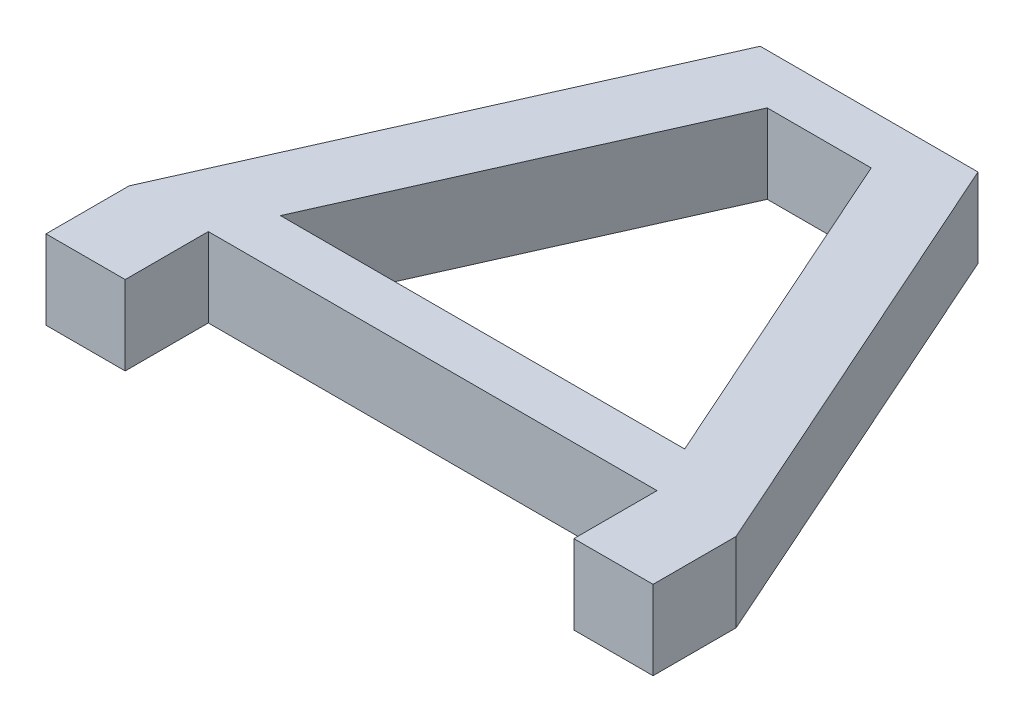
ISO-10303-21;
HEADER;
FILE_DESCRIPTION(('STEP AP214'),'2;1');
FILE_NAME('part.step','',(''),(''),'','','');
FILE_SCHEMA(('AUTOMOTIVE_DESIGN { 1 0 10303 214 1 1 1 1 }'));
ENDSEC;
DATA;
#1=APPLICATION_CONTEXT('core data for automotive mechanical design processes');
#2=APPLICATION_PROTOCOL_DEFINITION('international standard','automotive_design',2000,#1);
#3=PRODUCT_CONTEXT('',#1,'mechanical');
#4=PRODUCT('Part','Part','',(#3));
#5=PRODUCT_RELATED_PRODUCT_CATEGORY('part','',(#4));
#6=PRODUCT_DEFINITION_FORMATION('','',#4);
#7=PRODUCT_DEFINITION_CONTEXT('part definition',#1,'design');
#8=PRODUCT_DEFINITION('design','',#6,#7);
#9=PRODUCT_DEFINITION_SHAPE('','',#8);
#10=(LENGTH_UNIT() NAMED_UNIT(*) SI_UNIT(.MILLI.,.METRE.));
#11=(NAMED_UNIT(*) PLANE_ANGLE_UNIT() SI_UNIT($,.RADIAN.));
#12=(NAMED_UNIT(*) SI_UNIT($,.STERADIAN.) SOLID_ANGLE_UNIT());
#13=UNCERTAINTY_MEASURE_WITH_UNIT(LENGTH_MEASURE(1.E-05),#10,'distance_accuracy_value','');
#14=(GEOMETRIC_REPRESENTATION_CONTEXT(3) GLOBAL_UNCERTAINTY_ASSIGNED_CONTEXT((#13)) GLOBAL_UNIT_ASSIGNED_CONTEXT((#10,
#11,#12)) REPRESENTATION_CONTEXT('',''));
#15=CARTESIAN_POINT('',(0.,0.,0.));
#16=DIRECTION('',(0.,0.,1.));
#17=DIRECTION('',(1.,0.,0.));
#18=AXIS2_PLACEMENT_3D('',#15,#16,#17);
#19=CARTESIAN_POINT('',(0.,19.05,0.));
#20=DIRECTION('',(0.,-1.,0.));
#21=DIRECTION('',(0.,0.,-1.));
#22=AXIS2_PLACEMENT_3D('',#19,#20,#21);
#23=PLANE('',#22);
#24=DIRECTION('',(0.,0.,-1.));
#25=VECTOR('',#24,1.);
#26=CARTESIAN_POINT('',(73.025,19.05,10.));
#27=LINE('',#26,#25);
#28=CARTESIAN_POINT('',(73.025,19.05,10.));
#29=VERTEX_POINT('',#28);
#30=CARTESIAN_POINT('',(73.025,19.05,-10.));
#31=VERTEX_POINT('',#30);
#32=EDGE_CURVE('E172',#29,#31,#27,.T.);
#33=ORIENTED_EDGE('',*,*,#32,.T.);
#34=DIRECTION('',(-0.407299877583496,0.,-0.913294481380715));
#35=VECTOR('',#34,1.);
#36=CARTESIAN_POINT('',(73.025,19.05,-10.));
#37=LINE('',#36,#35);
#38=CARTESIAN_POINT('',(26.1983870967742,19.05,-115.));
#39=VERTEX_POINT('',#38);
#40=EDGE_CURVE('E175',#31,#39,#37,.T.);
#41=ORIENTED_EDGE('',*,*,#40,.T.);
#42=DIRECTION('',(-1.,0.,0.));
#43=VECTOR('',#42,1.);
#44=CARTESIAN_POINT('',(-26.1983870967742,19.05,-115.));
#45=LINE('',#44,#43);
#46=CARTESIAN_POINT('',(-26.1983870967742,19.05,-115.));
#47=VERTEX_POINT('',#46);
#48=EDGE_CURVE('E178',#39,#47,#45,.T.);
#49=ORIENTED_EDGE('',*,*,#48,.T.);
#50=DIRECTION('',(-0.407299877583496,0.,0.913294481380715));
#51=VECTOR('',#50,1.);
#52=CARTESIAN_POINT('',(-73.025,19.05,-10.));
#53=LINE('',#52,#51);
#54=CARTESIAN_POINT('',(-73.025,19.05,-10.));
#55=VERTEX_POINT('',#54);
#56=EDGE_CURVE('E180',#47,#55,#53,.T.);
#57=ORIENTED_EDGE('',*,*,#56,.T.);
#58=DIRECTION('',(0.,0.,1.));
#59=VECTOR('',#58,1.);
#60=CARTESIAN_POINT('',(-73.025,19.05,10.));
#61=LINE('',#60,#59);
#62=CARTESIAN_POINT('',(-73.025,19.05,10.));
#63=VERTEX_POINT('',#62);
#64=EDGE_CURVE('E182',#55,#63,#61,.T.);
#65=ORIENTED_EDGE('',*,*,#64,.T.);
#66=DIRECTION('',(1.,0.,0.));
#67=VECTOR('',#66,1.);
#68=CARTESIAN_POINT('',(-73.025,19.05,10.));
#69=LINE('',#68,#67);
#70=CARTESIAN_POINT('',(-53.975,19.05,10.));
#71=VERTEX_POINT('',#70);
#72=EDGE_CURVE('E184',#63,#71,#69,.T.);
#73=ORIENTED_EDGE('',*,*,#72,.T.);
#74=DIRECTION('',(0.,0.,-1.));
#75=VECTOR('',#74,1.);
#76=CARTESIAN_POINT('',(-53.975,19.05,-10.));
#77=LINE('',#76,#75);
#78=CARTESIAN_POINT('',(-53.975,19.05,-10.));
#79=VERTEX_POINT('',#78);
#80=EDGE_CURVE('E186',#71,#79,#77,.T.);
#81=ORIENTED_EDGE('',*,*,#80,.T.);
#82=DIRECTION('',(1.,0.,0.));
#83=VECTOR('',#82,1.);
#84=CARTESIAN_POINT('',(-53.975,19.05,-10.));
#85=LINE('',#84,#83);
#86=CARTESIAN_POINT('',(53.975,19.05,-10.));
#87=VERTEX_POINT('',#86);
#88=EDGE_CURVE('E188',#79,#87,#85,.T.);
#89=ORIENTED_EDGE('',*,*,#88,.T.);
#90=DIRECTION('',(0.,0.,1.));
#91=VECTOR('',#90,1.);
#92=CARTESIAN_POINT('',(53.975,19.05,-10.));
#93=LINE('',#92,#91);
#94=CARTESIAN_POINT('',(53.975,19.05,10.));
#95=VERTEX_POINT('',#94);
#96=EDGE_CURVE('E190',#87,#95,#93,.T.);
#97=ORIENTED_EDGE('',*,*,#96,.T.);
#98=DIRECTION('',(1.,0.,0.));
#99=VECTOR('',#98,1.);
#100=CARTESIAN_POINT('',(73.025,19.05,10.));
#101=LINE('',#100,#99);
#102=EDGE_CURVE('E192',#95,#29,#101,.T.);
#103=ORIENTED_EDGE('',*,*,#102,.T.);
#104=EDGE_LOOP('',(#33,#41,#49,#57,#65,#73,#81,#89,#97,#103));
#105=FACE_BOUND('',#104,.T.);
#106=DIRECTION('',(-0.407299877583496,0.,0.913294481380715));
#107=VECTOR('',#106,1.);
#108=CARTESIAN_POINT('',(-12.5,19.05,-103.));
#109=LINE('',#108,#107);
#110=CARTESIAN_POINT('',(-12.5,19.05,-103.));
#111=VERTEX_POINT('',#110);
#112=CARTESIAN_POINT('',(-48.6233870967742,19.05,-22.));
#113=VERTEX_POINT('',#112);
#114=EDGE_CURVE('E136',#111,#113,#109,.T.);
#115=ORIENTED_EDGE('',*,*,#114,.F.);
#116=DIRECTION('',(-1.,0.,0.));
#117=VECTOR('',#116,1.);
#118=CARTESIAN_POINT('',(-12.5,19.05,-103.));
#119=LINE('',#118,#117);
#120=CARTESIAN_POINT('',(12.5,19.05,-103.));
#121=VERTEX_POINT('',#120);
#122=EDGE_CURVE('E158',#121,#111,#119,.T.);
#123=ORIENTED_EDGE('',*,*,#122,.F.);
#124=DIRECTION('',(-0.407299877583496,0.,-0.913294481380715));
#125=VECTOR('',#124,1.);
#126=CARTESIAN_POINT('',(12.5,19.05,-103.));
#127=LINE('',#126,#125);
#128=CARTESIAN_POINT('',(48.6233870967742,19.05,-22.));
#129=VERTEX_POINT('',#128);
#130=EDGE_CURVE('E156',#129,#121,#127,.T.);
#131=ORIENTED_EDGE('',*,*,#130,.F.);
#132=DIRECTION('',(1.,0.,0.));
#133=VECTOR('',#132,1.);
#134=CARTESIAN_POINT('',(48.6233870967742,19.05,-22.));
#135=LINE('',#134,#133);
#136=EDGE_CURVE('E144',#113,#129,#135,.T.);
#137=ORIENTED_EDGE('',*,*,#136,.F.);
#138=EDGE_LOOP('',(#115,#123,#131,#137));
#139=FACE_BOUND('',#138,.T.);
#140=ADVANCED_FACE('F35',(#105,#139),#23,.F.);
#141=CARTESIAN_POINT('',(0.,0.,0.));
#142=DIRECTION('',(0.,-1.,0.));
#143=DIRECTION('',(0.,0.,-1.));
#144=AXIS2_PLACEMENT_3D('',#141,#142,#143);
#145=PLANE('',#144);
#146=DIRECTION('',(0.,0.,-1.));
#147=VECTOR('',#146,1.);
#148=CARTESIAN_POINT('',(73.025,0.,10.));
#149=LINE('',#148,#147);
#150=CARTESIAN_POINT('',(73.025,0.,10.));
#151=VERTEX_POINT('',#150);
#152=CARTESIAN_POINT('',(73.025,0.,-10.));
#153=VERTEX_POINT('',#152);
#154=EDGE_CURVE('E152',#151,#153,#149,.T.);
#155=ORIENTED_EDGE('',*,*,#154,.F.);
#156=DIRECTION('',(1.,0.,0.));
#157=VECTOR('',#156,1.);
#158=CARTESIAN_POINT('',(73.025,0.,10.));
#159=LINE('',#158,#157);
#160=CARTESIAN_POINT('',(53.975,0.,10.));
#161=VERTEX_POINT('',#160);
#162=EDGE_CURVE('E176',#161,#151,#159,.T.);
#163=ORIENTED_EDGE('',*,*,#162,.F.);
#164=DIRECTION('',(0.,0.,1.));
#165=VECTOR('',#164,1.);
#166=CARTESIAN_POINT('',(53.975,0.,-10.));
#167=LINE('',#166,#165);
#168=CARTESIAN_POINT('',(53.975,0.,-10.));
#169=VERTEX_POINT('',#168);
#170=EDGE_CURVE('E211',#169,#161,#167,.T.);
#171=ORIENTED_EDGE('',*,*,#170,.F.);
#172=DIRECTION('',(1.,0.,0.));
#173=VECTOR('',#172,1.);
#174=CARTESIAN_POINT('',(-53.975,0.,-10.));
#175=LINE('',#174,#173);
#176=CARTESIAN_POINT('',(-53.975,0.,-10.));
#177=VERTEX_POINT('',#176);
#178=EDGE_CURVE('E209',#177,#169,#175,.T.);
#179=ORIENTED_EDGE('',*,*,#178,.F.);
#180=DIRECTION('',(0.,0.,-1.));
#181=VECTOR('',#180,1.);
#182=CARTESIAN_POINT('',(-53.975,0.,-10.));
#183=LINE('',#182,#181);
#184=CARTESIAN_POINT('',(-53.975,0.,10.));
#185=VERTEX_POINT('',#184);
#186=EDGE_CURVE('E207',#185,#177,#183,.T.);
#187=ORIENTED_EDGE('',*,*,#186,.F.);
#188=DIRECTION('',(1.,0.,0.));
#189=VECTOR('',#188,1.);
#190=CARTESIAN_POINT('',(-73.025,0.,10.));
#191=LINE('',#190,#189);
#192=CARTESIAN_POINT('',(-73.025,0.,10.));
#193=VERTEX_POINT('',#192);
#194=EDGE_CURVE('E205',#193,#185,#191,.T.);
#195=ORIENTED_EDGE('',*,*,#194,.F.);
#196=DIRECTION('',(0.,0.,1.));
#197=VECTOR('',#196,1.);
#198=CARTESIAN_POINT('',(-73.025,0.,10.));
#199=LINE('',#198,#197);
#200=CARTESIAN_POINT('',(-73.025,0.,-10.));
#201=VERTEX_POINT('',#200);
#202=EDGE_CURVE('E203',#201,#193,#199,.T.);
#203=ORIENTED_EDGE('',*,*,#202,.F.);
#204=DIRECTION('',(-0.407299877583496,0.,0.913294481380715));
#205=VECTOR('',#204,1.);
#206=CARTESIAN_POINT('',(-73.025,0.,-10.));
#207=LINE('',#206,#205);
#208=CARTESIAN_POINT('',(-26.1983870967742,0.,-115.));
#209=VERTEX_POINT('',#208);
#210=EDGE_CURVE('E201',#209,#201,#207,.T.);
#211=ORIENTED_EDGE('',*,*,#210,.F.);
#212=DIRECTION('',(-1.,0.,0.));
#213=VECTOR('',#212,1.);
#214=CARTESIAN_POINT('',(-26.1983870967742,0.,-115.));
#215=LINE('',#214,#213);
#216=CARTESIAN_POINT('',(26.1983870967742,0.,-115.));
#217=VERTEX_POINT('',#216);
#218=EDGE_CURVE('E199',#217,#209,#215,.T.);
#219=ORIENTED_EDGE('',*,*,#218,.F.);
#220=DIRECTION('',(-0.407299877583496,0.,-0.913294481380715));
#221=VECTOR('',#220,1.);
#222=CARTESIAN_POINT('',(73.025,0.,-10.));
#223=LINE('',#222,#221);
#224=EDGE_CURVE('E197',#153,#217,#223,.T.);
#225=ORIENTED_EDGE('',*,*,#224,.F.);
#226=EDGE_LOOP('',(#155,#163,#171,#179,#187,#195,#203,#211,#219,#225));
#227=FACE_BOUND('',#226,.T.);
#228=DIRECTION('',(-1.,0.,0.));
#229=VECTOR('',#228,1.);
#230=CARTESIAN_POINT('',(-12.5,0.,-103.));
#231=LINE('',#230,#229);
#232=CARTESIAN_POINT('',(12.5,0.,-103.));
#233=VERTEX_POINT('',#232);
#234=CARTESIAN_POINT('',(-12.5,0.,-103.));
#235=VERTEX_POINT('',#234);
#236=EDGE_CURVE('E145',#233,#235,#231,.T.);
#237=ORIENTED_EDGE('',*,*,#236,.T.);
#238=DIRECTION('',(-0.407299877583496,0.,0.913294481380715));
#239=VECTOR('',#238,1.);
#240=CARTESIAN_POINT('',(-12.5,0.,-103.));
#241=LINE('',#240,#239);
#242=CARTESIAN_POINT('',(-48.6233870967742,0.,-22.));
#243=VERTEX_POINT('',#242);
#244=EDGE_CURVE('E58',#235,#243,#241,.T.);
#245=ORIENTED_EDGE('',*,*,#244,.T.);
#246=DIRECTION('',(1.,0.,0.));
#247=VECTOR('',#246,1.);
#248=CARTESIAN_POINT('',(48.6233870967742,0.,-22.));
#249=LINE('',#248,#247);
#250=CARTESIAN_POINT('',(48.6233870967742,0.,-22.));
#251=VERTEX_POINT('',#250);
#252=EDGE_CURVE('E151',#243,#251,#249,.T.);
#253=ORIENTED_EDGE('',*,*,#252,.T.);
#254=DIRECTION('',(-0.407299877583496,0.,-0.913294481380715));
#255=VECTOR('',#254,1.);
#256=CARTESIAN_POINT('',(12.5,0.,-103.));
#257=LINE('',#256,#255);
#258=EDGE_CURVE('E164',#251,#233,#257,.T.);
#259=ORIENTED_EDGE('',*,*,#258,.T.);
#260=EDGE_LOOP('',(#237,#245,#253,#259));
#261=FACE_BOUND('',#260,.T.);
#262=ADVANCED_FACE('F247',(#227,#261),#145,.T.);
#263=CARTESIAN_POINT('',(73.025,19.05,10.));
#264=DIRECTION('',(-1.,0.,0.));
#265=DIRECTION('',(0.,0.,1.));
#266=AXIS2_PLACEMENT_3D('',#263,#264,#265);
#267=PLANE('',#266);
#268=ORIENTED_EDGE('',*,*,#154,.T.);
#269=DIRECTION('',(0.,-1.,0.));
#270=VECTOR('',#269,1.);
#271=CARTESIAN_POINT('',(73.025,19.05,-10.));
#272=LINE('',#271,#270);
#273=EDGE_CURVE('E11',#31,#153,#272,.T.);
#274=ORIENTED_EDGE('',*,*,#273,.F.);
#275=ORIENTED_EDGE('',*,*,#32,.F.);
#276=DIRECTION('',(0.,-1.,0.));
#277=VECTOR('',#276,1.);
#278=CARTESIAN_POINT('',(73.025,19.05,10.));
#279=LINE('',#278,#277);
#280=EDGE_CURVE('E194',#29,#151,#279,.T.);
#281=ORIENTED_EDGE('',*,*,#280,.T.);
#282=EDGE_LOOP('',(#268,#274,#275,#281));
#283=FACE_BOUND('',#282,.T.);
#284=ADVANCED_FACE('F37',(#283),#267,.F.);
#285=CARTESIAN_POINT('',(73.025,19.05,-10.));
#286=DIRECTION('',(-0.913294481380715,0.,0.407299877583496));
#287=DIRECTION('',(0.407299877583496,0.,0.913294481380715));
#288=AXIS2_PLACEMENT_3D('',#285,#286,#287);
#289=PLANE('',#288);
#290=ORIENTED_EDGE('',*,*,#224,.T.);
#291=DIRECTION('',(0.,-1.,0.));
#292=VECTOR('',#291,1.);
#293=CARTESIAN_POINT('',(26.1983870967742,19.05,-115.));
#294=LINE('',#293,#292);
#295=EDGE_CURVE('E43',#39,#217,#294,.T.);
#296=ORIENTED_EDGE('',*,*,#295,.F.);
#297=ORIENTED_EDGE('',*,*,#40,.F.);
#298=ORIENTED_EDGE('',*,*,#273,.T.);
#299=EDGE_LOOP('',(#290,#296,#297,#298));
#300=FACE_BOUND('',#299,.T.);
#301=ADVANCED_FACE('F264',(#300),#289,.F.);
#302=CARTESIAN_POINT('',(-26.1983870967742,19.05,-115.));
#303=DIRECTION('',(0.,0.,1.));
#304=DIRECTION('',(1.,0.,0.));
#305=AXIS2_PLACEMENT_3D('',#302,#303,#304);
#306=PLANE('',#305);
#307=ORIENTED_EDGE('',*,*,#218,.T.);
#308=DIRECTION('',(0.,-1.,0.));
#309=VECTOR('',#308,1.);
#310=CARTESIAN_POINT('',(-26.1983870967742,19.05,-115.));
#311=LINE('',#310,#309);
#312=EDGE_CURVE('E234',#47,#209,#311,.T.);
#313=ORIENTED_EDGE('',*,*,#312,.F.);
#314=ORIENTED_EDGE('',*,*,#48,.F.);
#315=ORIENTED_EDGE('',*,*,#295,.T.);
#316=EDGE_LOOP('',(#307,#313,#314,#315));
#317=FACE_BOUND('',#316,.T.);
#318=ADVANCED_FACE('F241',(#317),#306,.F.);
#319=CARTESIAN_POINT('',(-73.025,19.05,-10.));
#320=DIRECTION('',(0.913294481380715,0.,0.407299877583496));
#321=DIRECTION('',(0.407299877583496,0.,-0.913294481380715));
#322=AXIS2_PLACEMENT_3D('',#319,#320,#321);
#323=PLANE('',#322);
#324=ORIENTED_EDGE('',*,*,#210,.T.);
#325=DIRECTION('',(0.,-1.,0.));
#326=VECTOR('',#325,1.);
#327=CARTESIAN_POINT('',(-73.025,19.05,-10.));
#328=LINE('',#327,#326);
#329=EDGE_CURVE('E231',#55,#201,#328,.T.);
#330=ORIENTED_EDGE('',*,*,#329,.F.);
#331=ORIENTED_EDGE('',*,*,#56,.F.);
#332=ORIENTED_EDGE('',*,*,#312,.T.);
#333=EDGE_LOOP('',(#324,#330,#331,#332));
#334=FACE_BOUND('',#333,.T.);
#335=ADVANCED_FACE('F253',(#334),#323,.F.);
#336=CARTESIAN_POINT('',(-73.025,19.05,10.));
#337=DIRECTION('',(1.,0.,0.));
#338=DIRECTION('',(0.,0.,-1.));
#339=AXIS2_PLACEMENT_3D('',#336,#337,#338);
#340=PLANE('',#339);
#341=ORIENTED_EDGE('',*,*,#202,.T.);
#342=DIRECTION('',(0.,-1.,0.));
#343=VECTOR('',#342,1.);
#344=CARTESIAN_POINT('',(-73.025,19.05,10.));
#345=LINE('',#344,#343);
#346=EDGE_CURVE('E228',#63,#193,#345,.T.);
#347=ORIENTED_EDGE('',*,*,#346,.F.);
#348=ORIENTED_EDGE('',*,*,#64,.F.);
#349=ORIENTED_EDGE('',*,*,#329,.T.);
#350=EDGE_LOOP('',(#341,#347,#348,#349));
#351=FACE_BOUND('',#350,.T.);
#352=ADVANCED_FACE('F257',(#351),#340,.F.);
#353=CARTESIAN_POINT('',(-73.025,19.05,10.));
#354=DIRECTION('',(0.,0.,-1.));
#355=DIRECTION('',(-1.,0.,0.));
#356=AXIS2_PLACEMENT_3D('',#353,#354,#355);
#357=PLANE('',#356);
#358=ORIENTED_EDGE('',*,*,#194,.T.);
#359=DIRECTION('',(0.,-1.,0.));
#360=VECTOR('',#359,1.);
#361=CARTESIAN_POINT('',(-53.975,19.05,10.));
#362=LINE('',#361,#360);
#363=EDGE_CURVE('E225',#71,#185,#362,.T.);
#364=ORIENTED_EDGE('',*,*,#363,.F.);
#365=ORIENTED_EDGE('',*,*,#72,.F.);
#366=ORIENTED_EDGE('',*,*,#346,.T.);
#367=EDGE_LOOP('',(#358,#364,#365,#366));
#368=FACE_BOUND('',#367,.T.);
#369=ADVANCED_FACE('F287',(#368),#357,.F.);
#370=CARTESIAN_POINT('',(-53.975,19.05,-10.));
#371=DIRECTION('',(-1.,0.,0.));
#372=DIRECTION('',(0.,0.,1.));
#373=AXIS2_PLACEMENT_3D('',#370,#371,#372);
#374=PLANE('',#373);
#375=ORIENTED_EDGE('',*,*,#186,.T.);
#376=DIRECTION('',(0.,-1.,0.));
#377=VECTOR('',#376,1.);
#378=CARTESIAN_POINT('',(-53.975,19.05,-10.));
#379=LINE('',#378,#377);
#380=EDGE_CURVE('E222',#79,#177,#379,.T.);
#381=ORIENTED_EDGE('',*,*,#380,.F.);
#382=ORIENTED_EDGE('',*,*,#80,.F.);
#383=ORIENTED_EDGE('',*,*,#363,.T.);
#384=EDGE_LOOP('',(#375,#381,#382,#383));
#385=FACE_BOUND('',#384,.T.);
#386=ADVANCED_FACE('F284',(#385),#374,.F.);
#387=CARTESIAN_POINT('',(-53.975,19.05,-10.));
#388=DIRECTION('',(0.,0.,-1.));
#389=DIRECTION('',(-1.,0.,0.));
#390=AXIS2_PLACEMENT_3D('',#387,#388,#389);
#391=PLANE('',#390);
#392=ORIENTED_EDGE('',*,*,#178,.T.);
#393=DIRECTION('',(0.,-1.,0.));
#394=VECTOR('',#393,1.);
#395=CARTESIAN_POINT('',(53.975,19.05,-10.));
#396=LINE('',#395,#394);
#397=EDGE_CURVE('E219',#87,#169,#396,.T.);
#398=ORIENTED_EDGE('',*,*,#397,.F.);
#399=ORIENTED_EDGE('',*,*,#88,.F.);
#400=ORIENTED_EDGE('',*,*,#380,.T.);
#401=EDGE_LOOP('',(#392,#398,#399,#400));
#402=FACE_BOUND('',#401,.T.);
#403=ADVANCED_FACE('F280',(#402),#391,.F.);
#404=CARTESIAN_POINT('',(53.975,19.05,-10.));
#405=DIRECTION('',(1.,0.,0.));
#406=DIRECTION('',(0.,0.,-1.));
#407=AXIS2_PLACEMENT_3D('',#404,#405,#406);
#408=PLANE('',#407);
#409=ORIENTED_EDGE('',*,*,#170,.T.);
#410=DIRECTION('',(0.,-1.,0.));
#411=VECTOR('',#410,1.);
#412=CARTESIAN_POINT('',(53.975,19.05,10.));
#413=LINE('',#412,#411);
#414=EDGE_CURVE('E216',#95,#161,#413,.T.);
#415=ORIENTED_EDGE('',*,*,#414,.F.);
#416=ORIENTED_EDGE('',*,*,#96,.F.);
#417=ORIENTED_EDGE('',*,*,#397,.T.);
#418=EDGE_LOOP('',(#409,#415,#416,#417));
#419=FACE_BOUND('',#418,.T.);
#420=ADVANCED_FACE('F276',(#419),#408,.F.);
#421=CARTESIAN_POINT('',(73.025,19.05,10.));
#422=DIRECTION('',(0.,0.,-1.));
#423=DIRECTION('',(-1.,0.,0.));
#424=AXIS2_PLACEMENT_3D('',#421,#422,#423);
#425=PLANE('',#424);
#426=ORIENTED_EDGE('',*,*,#162,.T.);
#427=ORIENTED_EDGE('',*,*,#280,.F.);
#428=ORIENTED_EDGE('',*,*,#102,.F.);
#429=ORIENTED_EDGE('',*,*,#414,.T.);
#430=EDGE_LOOP('',(#426,#427,#428,#429));
#431=FACE_BOUND('',#430,.T.);
#432=ADVANCED_FACE('F271',(#431),#425,.F.);
#433=CARTESIAN_POINT('',(-12.5,19.05,-103.));
#434=DIRECTION('',(0.913294481380715,0.,0.407299877583496));
#435=DIRECTION('',(0.407299877583496,0.,-0.913294481380715));
#436=AXIS2_PLACEMENT_3D('',#433,#434,#435);
#437=PLANE('',#436);
#438=ORIENTED_EDGE('',*,*,#244,.F.);
#439=DIRECTION('',(0.,-1.,0.));
#440=VECTOR('',#439,1.);
#441=CARTESIAN_POINT('',(-12.5,19.05,-103.));
#442=LINE('',#441,#440);
#443=EDGE_CURVE('E140',#111,#235,#442,.T.);
#444=ORIENTED_EDGE('',*,*,#443,.F.);
#445=ORIENTED_EDGE('',*,*,#114,.T.);
#446=DIRECTION('',(0.,-1.,0.));
#447=VECTOR('',#446,1.);
#448=CARTESIAN_POINT('',(-48.6233870967742,19.05,-22.));
#449=LINE('',#448,#447);
#450=EDGE_CURVE('E139',#113,#243,#449,.T.);
#451=ORIENTED_EDGE('',*,*,#450,.T.);
#452=EDGE_LOOP('',(#438,#444,#445,#451));
#453=FACE_BOUND('',#452,.T.);
#454=ADVANCED_FACE('F138',(#453),#437,.T.);
#455=CARTESIAN_POINT('',(48.6233870967742,19.05,-22.));
#456=DIRECTION('',(0.,0.,-1.));
#457=DIRECTION('',(-1.,0.,0.));
#458=AXIS2_PLACEMENT_3D('',#455,#456,#457);
#459=PLANE('',#458);
#460=ORIENTED_EDGE('',*,*,#252,.F.);
#461=ORIENTED_EDGE('',*,*,#450,.F.);
#462=ORIENTED_EDGE('',*,*,#136,.T.);
#463=DIRECTION('',(0.,-1.,0.));
#464=VECTOR('',#463,1.);
#465=CARTESIAN_POINT('',(48.6233870967742,19.05,-22.));
#466=LINE('',#465,#464);
#467=EDGE_CURVE('E153',#129,#251,#466,.T.);
#468=ORIENTED_EDGE('',*,*,#467,.T.);
#469=EDGE_LOOP('',(#460,#461,#462,#468));
#470=FACE_BOUND('',#469,.T.);
#471=ADVANCED_FACE('F148',(#470),#459,.T.);
#472=CARTESIAN_POINT('',(12.5,19.05,-103.));
#473=DIRECTION('',(-0.913294481380715,0.,0.407299877583496));
#474=DIRECTION('',(0.407299877583496,0.,0.913294481380715));
#475=AXIS2_PLACEMENT_3D('',#472,#473,#474);
#476=PLANE('',#475);
#477=ORIENTED_EDGE('',*,*,#258,.F.);
#478=ORIENTED_EDGE('',*,*,#467,.F.);
#479=ORIENTED_EDGE('',*,*,#130,.T.);
#480=DIRECTION('',(0.,-1.,0.));
#481=VECTOR('',#480,1.);
#482=CARTESIAN_POINT('',(12.5,19.05,-103.));
#483=LINE('',#482,#481);
#484=EDGE_CURVE('E50',#121,#233,#483,.T.);
#485=ORIENTED_EDGE('',*,*,#484,.T.);
#486=EDGE_LOOP('',(#477,#478,#479,#485));
#487=FACE_BOUND('',#486,.T.);
#488=ADVANCED_FACE('F333',(#487),#476,.T.);
#489=CARTESIAN_POINT('',(-12.5,19.05,-103.));
#490=DIRECTION('',(0.,0.,1.));
#491=DIRECTION('',(1.,0.,0.));
#492=AXIS2_PLACEMENT_3D('',#489,#490,#491);
#493=PLANE('',#492);
#494=ORIENTED_EDGE('',*,*,#236,.F.);
#495=ORIENTED_EDGE('',*,*,#484,.F.);
#496=ORIENTED_EDGE('',*,*,#122,.T.);
#497=ORIENTED_EDGE('',*,*,#443,.T.);
#498=EDGE_LOOP('',(#494,#495,#496,#497));
#499=FACE_BOUND('',#498,.T.);
#500=ADVANCED_FACE('F339',(#499),#493,.T.);
#501=CLOSED_SHELL('',(#140,#262,#284,#301,#318,#335,#352,#369,#386,#403,#420,#432,#454,#471,
#488,#500));
#502=MANIFOLD_SOLID_BREP('B2',#501);
#503=ADVANCED_BREP_SHAPE_REPRESENTATION('',(#18,#502),#14);
#504=SHAPE_DEFINITION_REPRESENTATION(#9,#503);
ENDSEC;
END-ISO-10303-21;
